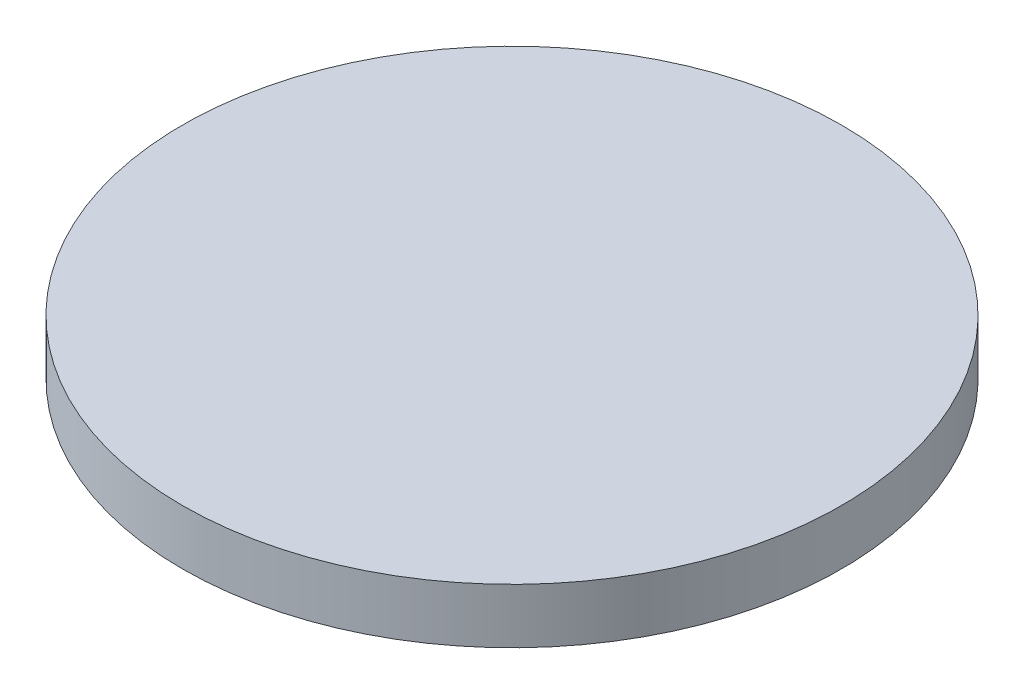
ISO-10303-21;
HEADER;
FILE_DESCRIPTION(('STEP AP214'),'2;1');
FILE_NAME('part.step','',(''),(''),'','','');
FILE_SCHEMA(('AUTOMOTIVE_DESIGN { 1 0 10303 214 1 1 1 1 }'));
ENDSEC;
DATA;
#1=APPLICATION_CONTEXT('core data for automotive mechanical design processes');
#2=APPLICATION_PROTOCOL_DEFINITION('international standard','automotive_design',2000,#1);
#3=PRODUCT_CONTEXT('',#1,'mechanical');
#4=PRODUCT('Part','Part','',(#3));
#5=PRODUCT_RELATED_PRODUCT_CATEGORY('part','',(#4));
#6=PRODUCT_DEFINITION_FORMATION('','',#4);
#7=PRODUCT_DEFINITION_CONTEXT('part definition',#1,'design');
#8=PRODUCT_DEFINITION('design','',#6,#7);
#9=PRODUCT_DEFINITION_SHAPE('','',#8);
#10=(LENGTH_UNIT() NAMED_UNIT(*) SI_UNIT(.MILLI.,.METRE.));
#11=(NAMED_UNIT(*) PLANE_ANGLE_UNIT() SI_UNIT($,.RADIAN.));
#12=(NAMED_UNIT(*) SI_UNIT($,.STERADIAN.) SOLID_ANGLE_UNIT());
#13=UNCERTAINTY_MEASURE_WITH_UNIT(LENGTH_MEASURE(1.E-05),#10,'distance_accuracy_value','');
#14=(GEOMETRIC_REPRESENTATION_CONTEXT(3) GLOBAL_UNCERTAINTY_ASSIGNED_CONTEXT((#13)) GLOBAL_UNIT_ASSIGNED_CONTEXT((#10,
#11,#12)) REPRESENTATION_CONTEXT('',''));
#15=CARTESIAN_POINT('',(0.,0.,0.));
#16=DIRECTION('',(0.,0.,1.));
#17=DIRECTION('',(1.,0.,0.));
#18=AXIS2_PLACEMENT_3D('',#15,#16,#17);
#19=CARTESIAN_POINT('',(0.,1.,0.));
#20=DIRECTION('',(0.,-1.,0.));
#21=DIRECTION('',(0.,0.,-1.));
#22=AXIS2_PLACEMENT_3D('',#19,#20,#21);
#23=CYLINDRICAL_SURFACE('',#22,6.);
#24=CARTESIAN_POINT('',(0.,1.,0.));
#25=DIRECTION('',(0.,1.,0.));
#26=DIRECTION('',(0.,0.,1.));
#27=AXIS2_PLACEMENT_3D('',#24,#25,#26);
#28=CIRCLE('',#27,6.);
#29=CARTESIAN_POINT('',(0.,1.,6.));
#30=VERTEX_POINT('',#29);
#31=EDGE_CURVE('E10',#30,#30,#28,.T.);
#32=ORIENTED_EDGE('',*,*,#31,.F.);
#33=EDGE_LOOP('',(#32));
#34=FACE_BOUND('',#33,.T.);
#35=CARTESIAN_POINT('',(0.,0.,0.));
#36=DIRECTION('',(0.,1.,0.));
#37=DIRECTION('',(0.,0.,1.));
#38=AXIS2_PLACEMENT_3D('',#35,#36,#37);
#39=CIRCLE('',#38,6.);
#40=CARTESIAN_POINT('',(0.,0.,6.));
#41=VERTEX_POINT('',#40);
#42=EDGE_CURVE('E50',#41,#41,#39,.T.);
#43=ORIENTED_EDGE('',*,*,#42,.T.);
#44=EDGE_LOOP('',(#43));
#45=FACE_BOUND('',#44,.T.);
#46=ADVANCED_FACE('F47',(#34,#45),#23,.T.);
#47=CARTESIAN_POINT('',(0.,1.,0.));
#48=DIRECTION('',(0.,1.,0.));
#49=DIRECTION('',(0.,0.,1.));
#50=AXIS2_PLACEMENT_3D('',#47,#48,#49);
#51=PLANE('',#50);
#52=ORIENTED_EDGE('',*,*,#31,.T.);
#53=EDGE_LOOP('',(#52));
#54=FACE_BOUND('',#53,.T.);
#55=ADVANCED_FACE('F66',(#54),#51,.T.);
#56=CARTESIAN_POINT('',(0.,0.,0.));
#57=DIRECTION('',(0.,1.,0.));
#58=DIRECTION('',(0.,0.,1.));
#59=AXIS2_PLACEMENT_3D('',#56,#57,#58);
#60=PLANE('',#59);
#61=ORIENTED_EDGE('',*,*,#42,.F.);
#62=EDGE_LOOP('',(#61));
#63=FACE_BOUND('',#62,.T.);
#64=ADVANCED_FACE('F64',(#63),#60,.F.);
#65=CLOSED_SHELL('',(#46,#55,#64));
#66=MANIFOLD_SOLID_BREP('B2',#65);
#67=ADVANCED_BREP_SHAPE_REPRESENTATION('',(#18,#66),#14);
#68=SHAPE_DEFINITION_REPRESENTATION(#9,#67);
ENDSEC;
END-ISO-10303-21;
